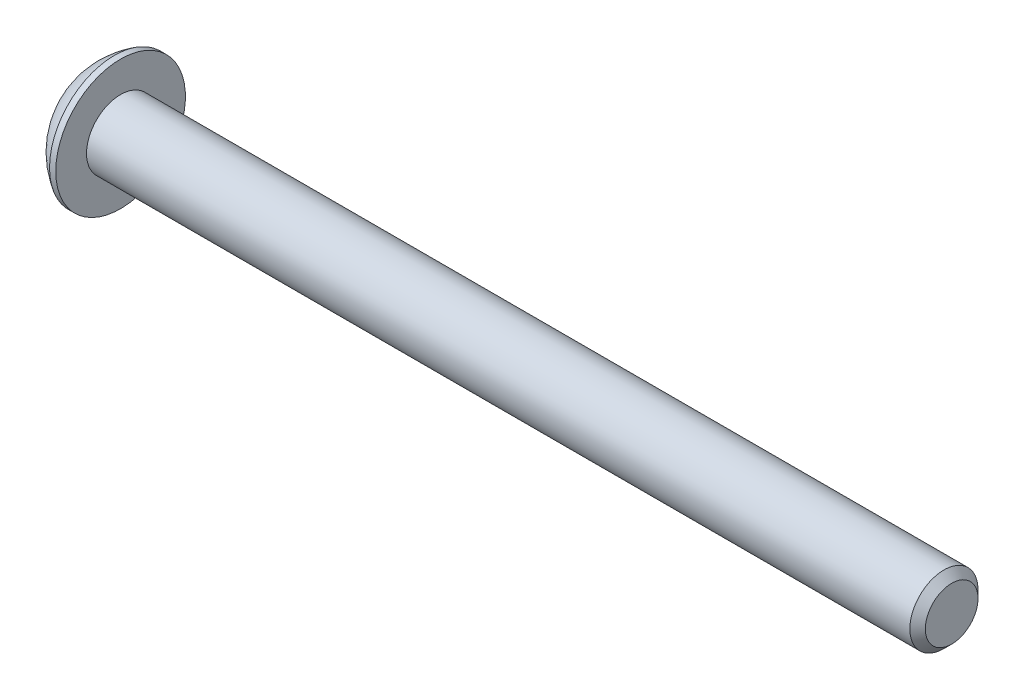
ISO-10303-21;
HEADER;
FILE_DESCRIPTION(('STEP AP214'),'2;1');
FILE_NAME('part.step','',(''),(''),'','','');
FILE_SCHEMA(('AUTOMOTIVE_DESIGN { 1 0 10303 214 1 1 1 1 }'));
ENDSEC;
DATA;
#1=APPLICATION_CONTEXT('core data for automotive mechanical design processes');
#2=APPLICATION_PROTOCOL_DEFINITION('international standard','automotive_design',2000,#1);
#3=PRODUCT_CONTEXT('',#1,'mechanical');
#4=PRODUCT('Part','Part','',(#3));
#5=PRODUCT_RELATED_PRODUCT_CATEGORY('part','',(#4));
#6=PRODUCT_DEFINITION_FORMATION('','',#4);
#7=PRODUCT_DEFINITION_CONTEXT('part definition',#1,'design');
#8=PRODUCT_DEFINITION('design','',#6,#7);
#9=PRODUCT_DEFINITION_SHAPE('','',#8);
#10=(LENGTH_UNIT() NAMED_UNIT(*) SI_UNIT(.MILLI.,.METRE.));
#11=(NAMED_UNIT(*) PLANE_ANGLE_UNIT() SI_UNIT($,.RADIAN.));
#12=(NAMED_UNIT(*) SI_UNIT($,.STERADIAN.) SOLID_ANGLE_UNIT());
#13=UNCERTAINTY_MEASURE_WITH_UNIT(LENGTH_MEASURE(1.E-05),#10,'distance_accuracy_value','');
#14=(GEOMETRIC_REPRESENTATION_CONTEXT(3) GLOBAL_UNCERTAINTY_ASSIGNED_CONTEXT((#13)) GLOBAL_UNIT_ASSIGNED_CONTEXT((#10,
#11,#12)) REPRESENTATION_CONTEXT('',''));
#15=CARTESIAN_POINT('',(0.,0.,0.));
#16=DIRECTION('',(0.,0.,1.));
#17=DIRECTION('',(1.,0.,0.));
#18=AXIS2_PLACEMENT_3D('',#15,#16,#17);
#19=CARTESIAN_POINT('',(1.32080000000612,1.66351716092754E-13,-1.94831130395645E-13));
#20=DIRECTION('',(-1.,0.,0.));
#21=DIRECTION('',(0.,0.,1.));
#22=AXIS2_PLACEMENT_3D('',#19,#20,#21);
#23=CONICAL_SURFACE('',#22,1.19380000000288,1.04719755119629);
#24=CARTESIAN_POINT('',(2.01004075136635,1.66533453693724E-13,-2.22044604925031E-13));
#25=VERTEX_POINT('',#24);
#26=VERTEX_LOOP('',#25);
#27=FACE_BOUND('',#26,.T.);
#28=CARTESIAN_POINT('',(1.32080000000612,1.66351716092754E-13,-1.94831130395645E-13));
#29=DIRECTION('',(-1.,0.,0.));
#30=DIRECTION('',(0.,0.,1.));
#31=AXIS2_PLACEMENT_3D('',#28,#29,#30);
#32=CIRCLE('',#31,1.19380000000288);
#33=CARTESIAN_POINT('',(1.32080000000338,-1.03386112703941,0.596900000000476));
#34=VERTEX_POINT('',#33);
#35=CARTESIAN_POINT('',(1.32080000000345,0.,1.19380000000156));
#36=VERTEX_POINT('',#35);
#37=EDGE_CURVE('E20',#34,#36,#32,.T.);
#38=ORIENTED_EDGE('',*,*,#37,.T.);
#39=CARTESIAN_POINT('',(1.32080000000612,1.66351716092754E-13,-1.94831130395645E-13));
#40=DIRECTION('',(-1.,0.,0.));
#41=DIRECTION('',(0.,0.,1.));
#42=AXIS2_PLACEMENT_3D('',#39,#40,#41);
#43=CIRCLE('',#42,1.19380000000288);
#44=CARTESIAN_POINT('',(1.3208000000034,1.03386112703939,0.596900000000358));
#45=VERTEX_POINT('',#44);
#46=EDGE_CURVE('E149',#36,#45,#43,.T.);
#47=ORIENTED_EDGE('',*,*,#46,.T.);
#48=CARTESIAN_POINT('',(1.32080000000586,1.66351716092754E-13,-1.94831130395645E-13));
#49=DIRECTION('',(-1.,0.,0.));
#50=DIRECTION('',(0.,0.,1.));
#51=AXIS2_PLACEMENT_3D('',#48,#49,#50);
#52=CIRCLE('',#51,1.19380000000333);
#53=CARTESIAN_POINT('',(1.32080000000271,1.03386112703932,-0.596900000001015));
#54=VERTEX_POINT('',#53);
#55=EDGE_CURVE('E451',#45,#54,#52,.T.);
#56=ORIENTED_EDGE('',*,*,#55,.T.);
#57=CARTESIAN_POINT('',(1.32080000000612,1.66351716092754E-13,-1.94831130395645E-13));
#58=DIRECTION('',(-1.,0.,0.));
#59=DIRECTION('',(0.,0.,1.));
#60=AXIS2_PLACEMENT_3D('',#57,#58,#59);
#61=CIRCLE('',#60,1.19380000000288);
#62=CARTESIAN_POINT('',(1.32080000000356,-4.43849399415455E-13,-1.19380000000167));
#63=VERTEX_POINT('',#62);
#64=EDGE_CURVE('E452',#54,#63,#61,.T.);
#65=ORIENTED_EDGE('',*,*,#64,.T.);
#66=CARTESIAN_POINT('',(1.32080000000586,1.66351716092754E-13,-1.94831130395645E-13));
#67=DIRECTION('',(-1.,0.,0.));
#68=DIRECTION('',(0.,0.,1.));
#69=AXIS2_PLACEMENT_3D('',#66,#67,#68);
#70=CIRCLE('',#69,1.19380000000333);
#71=CARTESIAN_POINT('',(1.32080000000305,-1.03386112703945,-0.596900000000904));
#72=VERTEX_POINT('',#71);
#73=EDGE_CURVE('E93',#63,#72,#70,.T.);
#74=ORIENTED_EDGE('',*,*,#73,.T.);
#75=CARTESIAN_POINT('',(1.32080000000586,1.66351716092754E-13,-1.94831130395645E-13));
#76=DIRECTION('',(-1.,0.,0.));
#77=DIRECTION('',(0.,0.,1.));
#78=AXIS2_PLACEMENT_3D('',#75,#76,#77);
#79=CIRCLE('',#78,1.19380000000333);
#80=EDGE_CURVE('E89',#72,#34,#79,.T.);
#81=ORIENTED_EDGE('',*,*,#80,.T.);
#82=EDGE_LOOP('',(#38,#47,#56,#65,#74,#81));
#83=FACE_BOUND('',#82,.T.);
#84=ADVANCED_FACE('F17',(#27,#83),#23,.F.);
#85=CARTESIAN_POINT('',(1.32080000000079,-2.06772225407553,-1.19379999999999));
#86=DIRECTION('',(1.,0.,0.));
#87=DIRECTION('',(0.,1.,0.));
#88=AXIS2_PLACEMENT_3D('',#85,#86,#87);
#89=PLANE('',#88);
#90=DIRECTION('',(0.,0.499999999999997,0.866025403784441));
#91=VECTOR('',#90,1.);
#92=CARTESIAN_POINT('',(1.32080000000001,-1.37848150271708,2.77555756156289E-13));
#93=LINE('',#92,#91);
#94=CARTESIAN_POINT('',(1.32080000000044,-0.689240751358723,1.19380000000003));
#95=VERTEX_POINT('',#94);
#96=EDGE_CURVE('E101',#95,#34,#93,.F.);
#97=ORIENTED_EDGE('',*,*,#96,.F.);
#98=DIRECTION('',(0.,1.,0.));
#99=VECTOR('',#98,1.);
#100=CARTESIAN_POINT('',(1.3208000000009,-0.689240751358677,1.19380000000019));
#101=LINE('',#100,#99);
#102=EDGE_CURVE('E103',#36,#95,#101,.F.);
#103=ORIENTED_EDGE('',*,*,#102,.F.);
#104=ORIENTED_EDGE('',*,*,#37,.F.);
#105=EDGE_LOOP('',(#97,#103,#104));
#106=FACE_BOUND('',#105,.T.);
#107=ADVANCED_FACE('F99',(#106),#89,.F.);
#108=CARTESIAN_POINT('',(1.32080000000079,-2.06772225407553,-1.19379999999999));
#109=DIRECTION('',(1.,0.,0.));
#110=DIRECTION('',(0.,1.,0.));
#111=AXIS2_PLACEMENT_3D('',#108,#109,#110);
#112=PLANE('',#111);
#113=DIRECTION('',(0.,-0.499999999999997,0.86602540378444));
#114=VECTOR('',#113,1.);
#115=CARTESIAN_POINT('',(1.32080000000001,-0.689240751358788,-1.19380000000038));
#116=LINE('',#115,#114);
#117=CARTESIAN_POINT('',(1.32080000000044,-1.37848150271735,-1.9489525838088E-13));
#118=VERTEX_POINT('',#117);
#119=EDGE_CURVE('E109',#118,#72,#116,.F.);
#120=ORIENTED_EDGE('',*,*,#119,.F.);
#121=DIRECTION('',(0.,0.499999999999997,0.866025403784441));
#122=VECTOR('',#121,1.);
#123=CARTESIAN_POINT('',(1.3208000000009,-1.37848150271708,2.77555756156289E-13));
#124=LINE('',#123,#122);
#125=EDGE_CURVE('E106',#34,#118,#124,.F.);
#126=ORIENTED_EDGE('',*,*,#125,.F.);
#127=ORIENTED_EDGE('',*,*,#80,.F.);
#128=EDGE_LOOP('',(#120,#126,#127));
#129=FACE_BOUND('',#128,.T.);
#130=ADVANCED_FACE('F107',(#129),#112,.F.);
#131=CARTESIAN_POINT('',(1.32080000000079,-2.06772225407553,-1.19379999999999));
#132=DIRECTION('',(1.,0.,0.));
#133=DIRECTION('',(0.,1.,0.));
#134=AXIS2_PLACEMENT_3D('',#131,#132,#133);
#135=PLANE('',#134);
#136=DIRECTION('',(0.,1.,0.));
#137=VECTOR('',#136,1.);
#138=CARTESIAN_POINT('',(1.32080000000045,0.689240751358788,-1.19380000000024));
#139=LINE('',#138,#137);
#140=CARTESIAN_POINT('',(1.32080000000044,-0.689240751358755,-1.19380000000028));
#141=VERTEX_POINT('',#140);
#142=EDGE_CURVE('E422',#141,#63,#139,.T.);
#143=ORIENTED_EDGE('',*,*,#142,.F.);
#144=DIRECTION('',(0.,-0.499999999999997,0.86602540378444));
#145=VECTOR('',#144,1.);
#146=CARTESIAN_POINT('',(1.32080000000023,-0.689240751358788,-1.19380000000038));
#147=LINE('',#146,#145);
#148=EDGE_CURVE('E434',#72,#141,#147,.F.);
#149=ORIENTED_EDGE('',*,*,#148,.F.);
#150=ORIENTED_EDGE('',*,*,#73,.F.);
#151=EDGE_LOOP('',(#143,#149,#150));
#152=FACE_BOUND('',#151,.T.);
#153=ADVANCED_FACE('F192',(#152),#135,.F.);
#154=CARTESIAN_POINT('',(1.32080000000079,-2.06772225407553,-1.19379999999999));
#155=DIRECTION('',(1.,0.,0.));
#156=DIRECTION('',(0.,1.,0.));
#157=AXIS2_PLACEMENT_3D('',#154,#155,#156);
#158=PLANE('',#157);
#159=DIRECTION('',(0.,-0.499999999999997,-0.866025403784441));
#160=VECTOR('',#159,1.);
#161=CARTESIAN_POINT('',(1.32080000000045,1.37848150271708,0.));
#162=LINE('',#161,#160);
#163=CARTESIAN_POINT('',(1.32080000000066,0.68924075135858,-1.1938000000001));
#164=VERTEX_POINT('',#163);
#165=EDGE_CURVE('E408',#164,#54,#162,.F.);
#166=ORIENTED_EDGE('',*,*,#165,.F.);
#167=DIRECTION('',(0.,1.,0.));
#168=VECTOR('',#167,1.);
#169=CARTESIAN_POINT('',(1.3208000000009,0.689240751358788,-1.19380000000024));
#170=LINE('',#169,#168);
#171=EDGE_CURVE('E419',#63,#164,#170,.T.);
#172=ORIENTED_EDGE('',*,*,#171,.F.);
#173=ORIENTED_EDGE('',*,*,#64,.F.);
#174=EDGE_LOOP('',(#166,#172,#173));
#175=FACE_BOUND('',#174,.T.);
#176=ADVANCED_FACE('F188',(#175),#158,.F.);
#177=CARTESIAN_POINT('',(1.32080000000079,-2.06772225407553,-1.19379999999999));
#178=DIRECTION('',(1.,0.,0.));
#179=DIRECTION('',(0.,1.,0.));
#180=AXIS2_PLACEMENT_3D('',#177,#178,#179);
#181=PLANE('',#180);
#182=DIRECTION('',(0.,0.499999999999997,-0.866025403784441));
#183=VECTOR('',#182,1.);
#184=CARTESIAN_POINT('',(1.32080000000068,0.689240751358788,1.1937999999998));
#185=LINE('',#184,#183);
#186=CARTESIAN_POINT('',(1.32080000000033,1.37848150271719,0.));
#187=VERTEX_POINT('',#186);
#188=EDGE_CURVE('E387',#187,#45,#185,.F.);
#189=ORIENTED_EDGE('',*,*,#188,.F.);
#190=DIRECTION('',(0.,-0.499999999999997,-0.866025403784441));
#191=VECTOR('',#190,1.);
#192=CARTESIAN_POINT('',(1.32079999999957,1.37848150271708,0.));
#193=LINE('',#192,#191);
#194=EDGE_CURVE('E406',#54,#187,#193,.F.);
#195=ORIENTED_EDGE('',*,*,#194,.F.);
#196=ORIENTED_EDGE('',*,*,#55,.F.);
#197=EDGE_LOOP('',(#189,#195,#196));
#198=FACE_BOUND('',#197,.T.);
#199=ADVANCED_FACE('F184',(#198),#181,.F.);
#200=CARTESIAN_POINT('',(1.32080000000079,-2.06772225407553,-1.19379999999999));
#201=DIRECTION('',(1.,0.,0.));
#202=DIRECTION('',(0.,1.,0.));
#203=AXIS2_PLACEMENT_3D('',#200,#201,#202);
#204=PLANE('',#203);
#205=DIRECTION('',(0.,1.,0.));
#206=VECTOR('',#205,1.);
#207=CARTESIAN_POINT('',(1.32080000000001,-0.689240751358677,1.19380000000019));
#208=LINE('',#207,#206);
#209=CARTESIAN_POINT('',(1.32080000000047,0.689240751358718,1.19380000000001));
#210=VERTEX_POINT('',#209);
#211=EDGE_CURVE('E118',#210,#36,#208,.F.);
#212=ORIENTED_EDGE('',*,*,#211,.F.);
#213=DIRECTION('',(0.,0.499999999999997,-0.866025403784441));
#214=VECTOR('',#213,1.);
#215=CARTESIAN_POINT('',(1.32080000000068,0.689240751358788,1.1937999999998));
#216=LINE('',#215,#214);
#217=EDGE_CURVE('E390',#45,#210,#216,.F.);
#218=ORIENTED_EDGE('',*,*,#217,.F.);
#219=ORIENTED_EDGE('',*,*,#46,.F.);
#220=EDGE_LOOP('',(#212,#218,#219));
#221=FACE_BOUND('',#220,.T.);
#222=ADVANCED_FACE('F180',(#221),#204,.F.);
#223=CARTESIAN_POINT('',(1.32080000000001,-0.689240751358677,1.19380000000019));
#224=DIRECTION('',(0.,0.,-1.));
#225=DIRECTION('',(0.,1.,0.));
#226=AXIS2_PLACEMENT_3D('',#223,#224,#225);
#227=PLANE('',#226);
#228=DIRECTION('',(0.,-1.,0.));
#229=VECTOR('',#228,1.);
#230=CARTESIAN_POINT('',(0.,0.,1.19379999999958));
#231=LINE('',#230,#229);
#232=CARTESIAN_POINT('',(4.44060342752892E-13,0.689240751358456,1.19379999999994));
#233=VERTEX_POINT('',#232);
#234=CARTESIAN_POINT('',(3.88477429996272E-13,-0.689240751358759,1.19379999999996));
#235=VERTEX_POINT('',#234);
#236=EDGE_CURVE('E384',#233,#235,#231,.T.);
#237=ORIENTED_EDGE('',*,*,#236,.F.);
#238=DIRECTION('',(1.,0.,0.));
#239=VECTOR('',#238,1.);
#240=CARTESIAN_POINT('',(1.32080000000001,0.689240751358788,1.1937999999998));
#241=LINE('',#240,#239);
#242=EDGE_CURVE('E396',#210,#233,#241,.F.);
#243=ORIENTED_EDGE('',*,*,#242,.F.);
#244=ORIENTED_EDGE('',*,*,#211,.T.);
#245=ORIENTED_EDGE('',*,*,#102,.T.);
#246=DIRECTION('',(1.,0.,0.));
#247=VECTOR('',#246,1.);
#248=CARTESIAN_POINT('',(1.32080000000001,-0.68924075135873,1.19379999999989));
#249=LINE('',#248,#247);
#250=EDGE_CURVE('E112',#235,#95,#249,.T.);
#251=ORIENTED_EDGE('',*,*,#250,.F.);
#252=EDGE_LOOP('',(#237,#243,#244,#245,#251));
#253=FACE_BOUND('',#252,.T.);
#254=ADVANCED_FACE('F177',(#253),#227,.T.);
#255=CARTESIAN_POINT('',(1.32080000000001,-1.37848150271708,2.77555756156289E-13));
#256=DIRECTION('',(0.,0.866025403784441,-0.499999999999997));
#257=DIRECTION('',(0.,0.499999999999997,0.866025403784441));
#258=AXIS2_PLACEMENT_3D('',#255,#256,#257);
#259=PLANE('',#258);
#260=DIRECTION('',(0.,-0.499999999999802,-0.866025403784553));
#261=VECTOR('',#260,1.);
#262=CARTESIAN_POINT('',(0.,-0.689240751358761,1.19379999999991));
#263=LINE('',#262,#261);
#264=CARTESIAN_POINT('',(1.11004751045778E-13,-1.37848150271714,0.));
#265=VERTEX_POINT('',#264);
#266=EDGE_CURVE('E381',#235,#265,#263,.T.);
#267=ORIENTED_EDGE('',*,*,#266,.F.);
#268=ORIENTED_EDGE('',*,*,#250,.T.);
#269=ORIENTED_EDGE('',*,*,#96,.T.);
#270=ORIENTED_EDGE('',*,*,#125,.T.);
#271=DIRECTION('',(1.,0.,0.));
#272=VECTOR('',#271,1.);
#273=CARTESIAN_POINT('',(1.32080000000045,-1.37848150271735,-3.95950633391706E-13));
#274=LINE('',#273,#272);
#275=EDGE_CURVE('E431',#265,#118,#274,.T.);
#276=ORIENTED_EDGE('',*,*,#275,.F.);
#277=EDGE_LOOP('',(#267,#268,#269,#270,#276));
#278=FACE_BOUND('',#277,.T.);
#279=ADVANCED_FACE('F116',(#278),#259,.T.);
#280=CARTESIAN_POINT('',(1.32080000000045,-0.689240751358788,-1.19380000000038));
#281=DIRECTION('',(0.,0.86602540378444,0.499999999999997));
#282=DIRECTION('',(0.,-0.499999999999997,0.86602540378444));
#283=AXIS2_PLACEMENT_3D('',#280,#281,#282);
#284=PLANE('',#283);
#285=DIRECTION('',(0.,0.499999999999867,-0.866025403784515));
#286=VECTOR('',#285,1.);
#287=CARTESIAN_POINT('',(0.,-1.37848150271705,-2.22044604925031E-13));
#288=LINE('',#287,#286);
#289=CARTESIAN_POINT('',(2.22073472022202E-13,-0.689240751358746,-1.19380000000031));
#290=VERTEX_POINT('',#289);
#291=EDGE_CURVE('E378',#265,#290,#288,.T.);
#292=ORIENTED_EDGE('',*,*,#291,.F.);
#293=ORIENTED_EDGE('',*,*,#275,.T.);
#294=ORIENTED_EDGE('',*,*,#119,.T.);
#295=ORIENTED_EDGE('',*,*,#148,.T.);
#296=DIRECTION('',(1.,0.,0.));
#297=VECTOR('',#296,1.);
#298=CARTESIAN_POINT('',(1.32080000000045,-0.689240751358705,-1.19380000000024));
#299=LINE('',#298,#297);
#300=EDGE_CURVE('E416',#290,#141,#299,.T.);
#301=ORIENTED_EDGE('',*,*,#300,.F.);
#302=EDGE_LOOP('',(#292,#293,#294,#295,#301));
#303=FACE_BOUND('',#302,.T.);
#304=ADVANCED_FACE('F170',(#303),#284,.T.);
#305=CARTESIAN_POINT('',(1.32080000000045,0.689240751358788,-1.19380000000024));
#306=DIRECTION('',(0.,0.,1.));
#307=DIRECTION('',(1.,0.,0.));
#308=AXIS2_PLACEMENT_3D('',#305,#306,#307);
#309=PLANE('',#308);
#310=DIRECTION('',(0.,-1.,0.));
#311=VECTOR('',#310,1.);
#312=CARTESIAN_POINT('',(0.,0.,-1.19380000000024));
#313=LINE('',#312,#311);
#314=CARTESIAN_POINT('',(6.65909182745881E-13,0.689240751358656,-1.19380000000018));
#315=VERTEX_POINT('',#314);
#316=EDGE_CURVE('E375',#290,#315,#313,.F.);
#317=ORIENTED_EDGE('',*,*,#316,.F.);
#318=ORIENTED_EDGE('',*,*,#300,.T.);
#319=ORIENTED_EDGE('',*,*,#142,.T.);
#320=ORIENTED_EDGE('',*,*,#171,.T.);
#321=DIRECTION('',(1.,0.,0.));
#322=VECTOR('',#321,1.);
#323=CARTESIAN_POINT('',(1.32080000000068,0.689240751358539,-1.1938));
#324=LINE('',#323,#322);
#325=EDGE_CURVE('E391',#315,#164,#324,.T.);
#326=ORIENTED_EDGE('',*,*,#325,.F.);
#327=EDGE_LOOP('',(#317,#318,#319,#320,#326));
#328=FACE_BOUND('',#327,.T.);
#329=ADVANCED_FACE('F167',(#328),#309,.T.);
#330=CARTESIAN_POINT('',(1.32080000000068,1.37848150271708,0.));
#331=DIRECTION('',(0.,-0.866025403784441,0.499999999999997));
#332=DIRECTION('',(0.,-0.499999999999997,-0.866025403784441));
#333=AXIS2_PLACEMENT_3D('',#330,#331,#332);
#334=PLANE('',#333);
#335=DIRECTION('',(0.,0.499999999999958,0.866025403784463));
#336=VECTOR('',#335,1.);
#337=CARTESIAN_POINT('',(0.,0.689240751358622,-1.19380000000005));
#338=LINE('',#337,#336);
#339=CARTESIAN_POINT('',(5.54912223294819E-13,1.37848150271713,0.));
#340=VERTEX_POINT('',#339);
#341=EDGE_CURVE('E372',#315,#340,#338,.T.);
#342=ORIENTED_EDGE('',*,*,#341,.F.);
#343=ORIENTED_EDGE('',*,*,#325,.T.);
#344=ORIENTED_EDGE('',*,*,#165,.T.);
#345=ORIENTED_EDGE('',*,*,#194,.T.);
#346=DIRECTION('',(1.,0.,0.));
#347=VECTOR('',#346,1.);
#348=CARTESIAN_POINT('',(1.32080000000001,1.37848150271723,0.));
#349=LINE('',#348,#347);
#350=EDGE_CURVE('E35',#340,#187,#349,.T.);
#351=ORIENTED_EDGE('',*,*,#350,.F.);
#352=EDGE_LOOP('',(#342,#343,#344,#345,#351));
#353=FACE_BOUND('',#352,.T.);
#354=ADVANCED_FACE('F163',(#353),#334,.T.);
#355=CARTESIAN_POINT('',(1.32080000000001,0.689240751358788,1.1937999999998));
#356=DIRECTION('',(0.,-0.866025403784441,-0.499999999999997));
#357=DIRECTION('',(0.,0.499999999999997,-0.866025403784441));
#358=AXIS2_PLACEMENT_3D('',#355,#356,#357);
#359=PLANE('',#358);
#360=DIRECTION('',(0.,-0.50000000000024,0.8660254037843));
#361=VECTOR('',#360,1.);
#362=CARTESIAN_POINT('',(0.,1.37848150271713,0.));
#363=LINE('',#362,#361);
#364=EDGE_CURVE('E148',#340,#233,#363,.T.);
#365=ORIENTED_EDGE('',*,*,#364,.F.);
#366=ORIENTED_EDGE('',*,*,#350,.T.);
#367=ORIENTED_EDGE('',*,*,#188,.T.);
#368=ORIENTED_EDGE('',*,*,#217,.T.);
#369=ORIENTED_EDGE('',*,*,#242,.T.);
#370=EDGE_LOOP('',(#365,#366,#367,#368,#369));
#371=FACE_BOUND('',#370,.T.);
#372=ADVANCED_FACE('F159',(#371),#359,.T.);
#373=CARTESIAN_POINT('',(0.,0.,0.));
#374=DIRECTION('',(-1.,0.,0.));
#375=DIRECTION('',(0.,-1.,0.));
#376=AXIS2_PLACEMENT_3D('',#373,#374,#375);
#377=PLANE('',#376);
#378=ORIENTED_EDGE('',*,*,#341,.T.);
#379=ORIENTED_EDGE('',*,*,#364,.T.);
#380=ORIENTED_EDGE('',*,*,#236,.T.);
#381=ORIENTED_EDGE('',*,*,#266,.T.);
#382=ORIENTED_EDGE('',*,*,#291,.T.);
#383=ORIENTED_EDGE('',*,*,#316,.T.);
#384=EDGE_LOOP('',(#378,#379,#380,#381,#382,#383));
#385=FACE_BOUND('',#384,.T.);
#386=CARTESIAN_POINT('',(0.,1.9811999999985,-2.22067583786152E-13));
#387=CARTESIAN_POINT('',(0.,1.9811996664284,0.0556258831176761));
#388=CARTESIAN_POINT('',(0.,1.97885520380293,0.111261989398294));
#389=CARTESIAN_POINT('',(0.,1.96949260169392,0.222149719830056));
#390=CARTESIAN_POINT('',(0.,1.96247308239457,0.277401225602449));
#391=CARTESIAN_POINT('',(0.,1.94379192840892,0.387209508139213));
#392=CARTESIAN_POINT('',(-1.85970526756621E-13,1.9321229248938,0.441765039545786));
#393=CARTESIAN_POINT('',(1.85164842304934E-13,1.90422331175172,0.549729449346826));
#394=CARTESIAN_POINT('',(6.92546839237099E-13,1.88798900035196,0.60313735920816));
#395=CARTESIAN_POINT('',(1.1521718417219E-12,1.83266214476363,0.76083913132099));
#396=CARTESIAN_POINT('',(0.,1.78690023648711,0.862876433574509));
#397=CARTESIAN_POINT('',(0.,1.67887358150542,1.05780719540764));
#398=CARTESIAN_POINT('',(9.53170182203906E-13,1.6166082074573,1.15070030720685));
#399=CARTESIAN_POINT('',(5.93771288092152E-13,1.5122415714087,1.28116890915572));
#400=CARTESIAN_POINT('',(1.62342264507105E-13,1.47559703943431,1.32320451126897));
#401=CARTESIAN_POINT('',(-1.62791999021024E-13,1.39893832619611,1.40400288695573));
#402=CARTESIAN_POINT('',(0.,1.35892742784599,1.44276877695316));
#403=CARTESIAN_POINT('',(1.13198539834661E-13,1.23416504602108,1.55382272417756));
#404=CARTESIAN_POINT('',(0.,1.14466125559777,1.62089527951957));
#405=CARTESIAN_POINT('',(0.,0.955712144177497,1.73902218081016));
#406=CARTESIAN_POINT('',(0.,0.856267198232977,1.7900771307584));
#407=CARTESIAN_POINT('',(0.,0.650206345910423,1.8747763753078));
#408=CARTESIAN_POINT('',(0.,0.543590516134521,1.9084208558609));
#409=CARTESIAN_POINT('',(0.,0.326226155291861,1.95733039300475));
#410=CARTESIAN_POINT('',(0.,0.215477602157863,1.97259535144106));
#411=CARTESIAN_POINT('',(0.,-0.00701040587533257,1.98431697865235));
#412=CARTESIAN_POINT('',(0.,-0.118749860774529,1.98077364742734));
#413=CARTESIAN_POINT('',(0.,-0.340050178355101,1.95497485623644));
#414=CARTESIAN_POINT('',(0.,-0.449611052667782,1.93271949620038));
#415=CARTESIAN_POINT('',(0.,-0.663431110728528,1.8701413877435));
#416=CARTESIAN_POINT('',(0.,-0.76769023783779,1.82981844635102));
#417=CARTESIAN_POINT('',(0.,-0.968005760718453,1.73219968376934));
#418=CARTESIAN_POINT('',(0.,-1.06406184698013,1.67490322251482));
#419=CARTESIAN_POINT('',(0.,-1.19980276751175,1.57757371205723));
#420=CARTESIAN_POINT('',(0.,-1.24366557129101,1.54322665019318));
#421=CARTESIAN_POINT('',(0.,-1.32838995706577,1.47093063174122));
#422=CARTESIAN_POINT('',(0.,-1.36924860178584,1.43297823102301));
#423=CARTESIAN_POINT('',(0.,-1.48674671849091,1.31419842051044));
#424=CARTESIAN_POINT('',(0.,-1.558428323431,1.22836221289189));
#425=CARTESIAN_POINT('',(0.,-1.68633968564602,1.04586168272386));
#426=CARTESIAN_POINT('',(0.,-1.74257003024727,0.949197771948779));
#427=CARTESIAN_POINT('',(0.,-1.81416142503852,0.798182600297811));
#428=CARTESIAN_POINT('',(0.,-1.83591780585715,0.746776203846961));
#429=CARTESIAN_POINT('',(0.,-1.87500754180929,0.64234108168789));
#430=CARTESIAN_POINT('',(0.,-1.89234447645239,0.589313708122144));
#431=CARTESIAN_POINT('',(0.,-1.92246053433388,0.482076273027779));
#432=CARTESIAN_POINT('',(0.,-1.9352468547495,0.427868224256939));
#433=CARTESIAN_POINT('',(0.,-1.95620937250324,0.318578151844129));
#434=CARTESIAN_POINT('',(0.,-1.96438692957977,0.263496390912434));
#435=CARTESIAN_POINT('',(0.,-1.97388528284482,0.173607715038192));
#436=CARTESIAN_POINT('',(0.,-1.97662743364255,0.13894471802466));
#437=CARTESIAN_POINT('',(0.,-1.98028489645112,0.0695224782564175));
#438=CARTESIAN_POINT('',(0.,-1.98120020846196,0.034763235501708));
#439=CARTESIAN_POINT('',(0.,-1.98119966642818,-0.0556258831181263));
#440=CARTESIAN_POINT('',(0.,-1.97885520380271,-0.111261989398745));
#441=CARTESIAN_POINT('',(0.,-1.9694926016937,-0.222149719830506));
#442=CARTESIAN_POINT('',(0.,-1.96247308239435,-0.277401225602899));
#443=CARTESIAN_POINT('',(0.,-1.9437919284087,-0.387209508139663));
#444=CARTESIAN_POINT('',(-1.84612856337694E-13,-1.93212292489358,-0.441765039546237));
#445=CARTESIAN_POINT('',(1.85719898490118E-13,-1.90422331175149,-0.549729449347277));
#446=CARTESIAN_POINT('',(6.92269117408861E-13,-1.88798900035174,-0.60313735920861));
#447=CARTESIAN_POINT('',(1.15080117495965E-12,-1.8326621447634,-0.76083913132144));
#448=CARTESIAN_POINT('',(0.,-1.78690023648689,-0.862876433574959));
#449=CARTESIAN_POINT('',(0.,-1.67887358150519,-1.05780719540809));
#450=CARTESIAN_POINT('',(9.55972885107265E-13,-1.61660820745708,-1.15070030720731));
#451=CARTESIAN_POINT('',(5.95461081195326E-13,-1.51224157140848,-1.28116890915617));
#452=CARTESIAN_POINT('',(1.63236221994992E-13,-1.47559703943409,-1.32320451126942));
#453=CARTESIAN_POINT('',(-1.6247258078296E-13,-1.39893832619588,-1.40400288695618));
#454=CARTESIAN_POINT('',(0.,-1.35892742784577,-1.44276877695361));
#455=CARTESIAN_POINT('',(1.13710312912053E-13,-1.23416504602085,-1.553822724178));
#456=CARTESIAN_POINT('',(0.,-1.14466125559754,-1.62089527952002));
#457=CARTESIAN_POINT('',(0.,-0.955712144177271,-1.73902218081061));
#458=CARTESIAN_POINT('',(0.,-0.856267198232749,-1.79007713075885));
#459=CARTESIAN_POINT('',(0.,-0.650206345910196,-1.87477637530824));
#460=CARTESIAN_POINT('',(0.,-0.543590516134295,-1.90842085586134));
#461=CARTESIAN_POINT('',(0.,-0.326226155291636,-1.9573303930052));
#462=CARTESIAN_POINT('',(0.,-0.215477602157637,-1.9725953514415));
#463=CARTESIAN_POINT('',(0.,0.0070104058755589,-1.98431697865279));
#464=CARTESIAN_POINT('',(0.,0.118749860774756,-1.98077364742778));
#465=CARTESIAN_POINT('',(0.,0.340050178355328,-1.95497485623688));
#466=CARTESIAN_POINT('',(0.,0.44961105266801,-1.93271949620083));
#467=CARTESIAN_POINT('',(0.,0.663431110728755,-1.87014138774394));
#468=CARTESIAN_POINT('',(0.,0.767690237838017,-1.82981844635146));
#469=CARTESIAN_POINT('',(0.,0.968005760718679,-1.73219968376978));
#470=CARTESIAN_POINT('',(0.,1.06406184698035,-1.67490322251525));
#471=CARTESIAN_POINT('',(0.,1.19980276751198,-1.57757371205767));
#472=CARTESIAN_POINT('',(0.,1.24366557129124,-1.54322665019362));
#473=CARTESIAN_POINT('',(0.,1.328389957066,-1.47093063174166));
#474=CARTESIAN_POINT('',(0.,1.36924860178607,-1.43297823102345));
#475=CARTESIAN_POINT('',(0.,1.48674671849114,-1.31419842051087));
#476=CARTESIAN_POINT('',(0.,1.55842832343122,-1.22836221289233));
#477=CARTESIAN_POINT('',(0.,1.68633968564624,-1.04586168272429));
#478=CARTESIAN_POINT('',(0.,1.74257003024749,-0.949197771949215));
#479=CARTESIAN_POINT('',(0.,1.81416142503874,-0.798182600298248));
#480=CARTESIAN_POINT('',(0.,1.83591780585737,-0.746776203847397));
#481=CARTESIAN_POINT('',(0.,1.87500754180951,-0.642341081688327));
#482=CARTESIAN_POINT('',(0.,1.89234447645262,-0.589313708122581));
#483=CARTESIAN_POINT('',(0.,1.9224605343341,-0.482076273028215));
#484=CARTESIAN_POINT('',(0.,1.93524685474972,-0.427868224257374));
#485=CARTESIAN_POINT('',(0.,1.95620937250346,-0.318578151844564));
#486=CARTESIAN_POINT('',(0.,1.96438692957999,-0.263496390912869));
#487=CARTESIAN_POINT('',(0.,1.97388528284504,-0.17360771503863));
#488=CARTESIAN_POINT('',(0.,1.97662743364277,-0.1389447180251));
#489=CARTESIAN_POINT('',(0.,1.98028489645134,-0.0695224782568627));
#490=CARTESIAN_POINT('',(0.,1.98120020846218,-0.0347632355021556));
#491=CARTESIAN_POINT('',(0.,1.9811999999985,-2.22067583786152E-13));
#492=B_SPLINE_CURVE_WITH_KNOTS('',3,(#386,#387,#388,#389,#390,#391,#392,#393,#394,#395,#396,
#397,#398,#399,#400,#401,#402,#403,#404,#405,#406,#407,#408,#409,#410,#411,#412,#413,#414,#415,
#416,#417,#418,#419,#420,#421,#422,#423,#424,#425,#426,#427,#428,#429,#430,#431,#432,#433,#434,
#435,#436,#437,#438,#439,#440,#441,#442,#443,#444,#445,#446,#447,#448,#449,#450,#451,#452,#453,
#454,#455,#456,#457,#458,#459,#460,#461,#462,#463,#464,#465,#466,#467,#468,#469,#470,#471,#472,
#473,#474,#475,#476,#477,#478,#479,#480,#481,#482,#483,#484,#485,#486,#487,#488,#489,#490,#491),
.UNSPECIFIED.,.T.,.F.,(4,2,2,2,2,2,2,2,2,2,2,2,2,2,2,2,2,2,2,2,2,2,2,2,2,2,2,2,2,2,2,2,2,2,2,2,
2,2,2,2,2,2,2,2,2,2,2,2,2,2,2,2,4),(0.,0.166845646007693,0.333740557373985,0.500901034367288,
0.668197445941846,1.00199278686201,1.33580081809777,1.5029235403286,1.66988513108395,
2.00370118899967,2.33750465770355,2.67130456115693,3.00510624723557,3.33890793331425,
3.67270783676767,4.00651130547151,4.34032736338674,4.50728895414189,4.67441167637253,
5.00821970760853,5.34201504852899,5.5093114601038,5.67647193709731,5.8433668484637,
6.01021249447153,6.11448220057838,6.21875190668525,6.38559755269294,6.55249246405923,
6.71965294105254,6.8869493526271,7.22074469354726,7.55455272478302,7.72167544701385,
7.8886370377692,8.22245309568492,8.5562565643888,8.89005646784218,9.22385815392082,
9.5576598399995,9.89145974345292,10.2252632121568,10.559079270072,10.7260408608271,
10.8931635830578,11.2269716142938,11.5607669552142,11.7280633667891,11.8952238437826,
12.062118755149,12.2289644011568,12.3332341072636,12.4375038133705),.UNSPECIFIED.);
#493=CARTESIAN_POINT('',(0.,1.9811999999985,-2.22067583786152E-13));
#494=VERTEX_POINT('',#493);
#495=EDGE_CURVE('E140',#494,#494,#492,.T.);
#496=ORIENTED_EDGE('',*,*,#495,.F.);
#497=EDGE_LOOP('',(#496));
#498=FACE_BOUND('',#497,.T.);
#499=ADVANCED_FACE('F155',(#385,#498),#377,.T.);
#500=CARTESIAN_POINT('',(4.13385000000077,1.11022302462516E-13,-2.22044604925031E-13));
#501=DIRECTION('',(0.,1.,0.));
#502=DIRECTION('',(1.,0.,0.));
#503=AXIS2_PLACEMENT_3D('',#500,#501,#502);
#504=SPHERICAL_SURFACE('',#503,4.58408870578439);
#505=CARTESIAN_POINT('',(1.82880000000052,0.,0.));
#506=DIRECTION('',(-1.,0.,0.));
#507=DIRECTION('',(0.,0.,1.));
#508=AXIS2_PLACEMENT_3D('',#505,#506,#507);
#509=CIRCLE('',#508,3.96240000000001);
#510=CARTESIAN_POINT('',(1.82880000000052,0.,3.96240000000001));
#511=VERTEX_POINT('',#510);
#512=EDGE_CURVE('E137',#511,#511,#509,.F.);
#513=ORIENTED_EDGE('',*,*,#512,.F.);
#514=EDGE_LOOP('',(#513));
#515=FACE_BOUND('',#514,.T.);
#516=ORIENTED_EDGE('',*,*,#495,.T.);
#517=EDGE_LOOP('',(#516));
#518=FACE_BOUND('',#517,.T.);
#519=ADVANCED_FACE('F151',(#515,#518),#504,.T.);
#520=CARTESIAN_POINT('',(53.009800000001,0.,0.));
#521=DIRECTION('',(-1.,0.,0.));
#522=DIRECTION('',(0.,-1.,0.));
#523=AXIS2_PLACEMENT_3D('',#520,#521,#522);
#524=PLANE('',#523);
#525=CARTESIAN_POINT('',(53.0097999999839,0.,0.));
#526=DIRECTION('',(-1.,0.,0.));
#527=DIRECTION('',(0.,-1.,0.));
#528=AXIS2_PLACEMENT_3D('',#525,#526,#527);
#529=CIRCLE('',#528,1.61035999991557);
#530=CARTESIAN_POINT('',(53.0097999999839,-1.61035999991557,0.));
#531=VERTEX_POINT('',#530);
#532=EDGE_CURVE('E134',#531,#531,#529,.T.);
#533=ORIENTED_EDGE('',*,*,#532,.F.);
#534=EDGE_LOOP('',(#533));
#535=FACE_BOUND('',#534,.T.);
#536=ADVANCED_FACE('F222',(#535),#524,.F.);
#537=CARTESIAN_POINT('',(0.,0.,0.));
#538=DIRECTION('',(-1.,0.,0.));
#539=DIRECTION('',(0.,0.,1.));
#540=AXIS2_PLACEMENT_3D('',#537,#538,#539);
#541=CYLINDRICAL_SURFACE('',#540,3.96240000000001);
#542=ORIENTED_EDGE('',*,*,#512,.T.);
#543=EDGE_LOOP('',(#542));
#544=FACE_BOUND('',#543,.T.);
#545=CARTESIAN_POINT('',(2.20980000000104,0.,0.));
#546=DIRECTION('',(-1.,0.,0.));
#547=DIRECTION('',(0.,0.,1.));
#548=AXIS2_PLACEMENT_3D('',#545,#546,#547);
#549=CIRCLE('',#548,3.96240000000001);
#550=CARTESIAN_POINT('',(2.20980000000104,0.,3.96240000000001));
#551=VERTEX_POINT('',#550);
#552=EDGE_CURVE('E131',#551,#551,#549,.T.);
#553=ORIENTED_EDGE('',*,*,#552,.T.);
#554=EDGE_LOOP('',(#553));
#555=FACE_BOUND('',#554,.T.);
#556=ADVANCED_FACE('F219',(#544,#555),#541,.T.);
#557=CARTESIAN_POINT('',(52.537359999917,0.,0.));
#558=DIRECTION('',(-1.,0.,0.));
#559=DIRECTION('',(0.,-1.,0.));
#560=AXIS2_PLACEMENT_3D('',#557,#558,#559);
#561=CONICAL_SURFACE('',#560,2.08279999998243,0.785398163397448);
#562=CARTESIAN_POINT('',(52.5373600000005,0.,0.));
#563=DIRECTION('',(-1.,0.,0.));
#564=DIRECTION('',(0.,0.,1.));
#565=AXIS2_PLACEMENT_3D('',#562,#563,#564);
#566=CIRCLE('',#565,2.0828);
#567=CARTESIAN_POINT('',(52.5373600000005,0.,2.08280000000005));
#568=VERTEX_POINT('',#567);
#569=EDGE_CURVE('E26',#568,#568,#566,.T.);
#570=ORIENTED_EDGE('',*,*,#569,.F.);
#571=EDGE_LOOP('',(#570));
#572=FACE_BOUND('',#571,.T.);
#573=ORIENTED_EDGE('',*,*,#532,.T.);
#574=EDGE_LOOP('',(#573));
#575=FACE_BOUND('',#574,.T.);
#576=ADVANCED_FACE('F212',(#572,#575),#561,.T.);
#577=CARTESIAN_POINT('',(2.20980000000026,2.08280000000016,-2.22044604925031E-13));
#578=DIRECTION('',(-1.,0.,0.));
#579=DIRECTION('',(0.,-1.,0.));
#580=AXIS2_PLACEMENT_3D('',#577,#578,#579);
#581=PLANE('',#580);
#582=CARTESIAN_POINT('',(2.20980000000104,0.,0.));
#583=DIRECTION('',(-1.,0.,0.));
#584=DIRECTION('',(0.,0.,1.));
#585=AXIS2_PLACEMENT_3D('',#582,#583,#584);
#586=CIRCLE('',#585,2.0828);
#587=CARTESIAN_POINT('',(2.20980000000104,0.,2.0828));
#588=VERTEX_POINT('',#587);
#589=EDGE_CURVE('E11',#588,#588,#586,.F.);
#590=ORIENTED_EDGE('',*,*,#589,.F.);
#591=EDGE_LOOP('',(#590));
#592=FACE_BOUND('',#591,.T.);
#593=ORIENTED_EDGE('',*,*,#552,.F.);
#594=EDGE_LOOP('',(#593));
#595=FACE_BOUND('',#594,.T.);
#596=ADVANCED_FACE('F206',(#592,#595),#581,.F.);
#597=CARTESIAN_POINT('',(0.,0.,0.));
#598=DIRECTION('',(-1.,0.,0.));
#599=DIRECTION('',(0.,0.,1.));
#600=AXIS2_PLACEMENT_3D('',#597,#598,#599);
#601=CYLINDRICAL_SURFACE('',#600,2.0828);
#602=ORIENTED_EDGE('',*,*,#589,.T.);
#603=EDGE_LOOP('',(#602));
#604=FACE_BOUND('',#603,.T.);
#605=ORIENTED_EDGE('',*,*,#569,.T.);
#606=EDGE_LOOP('',(#605));
#607=FACE_BOUND('',#606,.T.);
#608=ADVANCED_FACE('F204',(#604,#607),#601,.T.);
#609=CLOSED_SHELL('',(#84,#107,#130,#153,#176,#199,#222,#254,#279,#304,#329,#354,#372,#499,#519,
#536,#556,#576,#596,#608));
#610=MANIFOLD_SOLID_BREP('B1',#609);
#611=ADVANCED_BREP_SHAPE_REPRESENTATION('',(#18,#610),#14);
#612=SHAPE_DEFINITION_REPRESENTATION(#9,#611);
ENDSEC;
END-ISO-10303-21;
